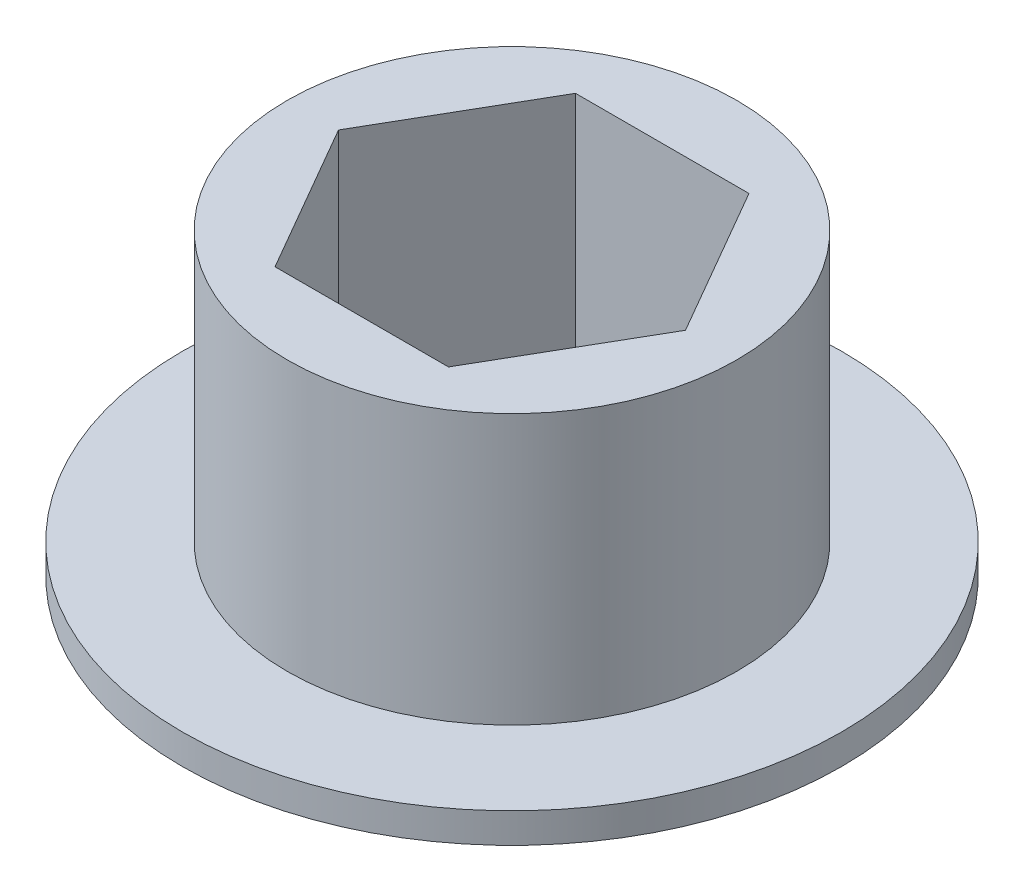
ISO-10303-21;
HEADER;
FILE_DESCRIPTION(('STEP AP214'),'2;1');
FILE_NAME('part.step','',(''),(''),'','','');
FILE_SCHEMA(('AUTOMOTIVE_DESIGN { 1 0 10303 214 1 1 1 1 }'));
ENDSEC;
DATA;
#1=APPLICATION_CONTEXT('core data for automotive mechanical design processes');
#2=APPLICATION_PROTOCOL_DEFINITION('international standard','automotive_design',2000,#1);
#3=PRODUCT_CONTEXT('',#1,'mechanical');
#4=PRODUCT('Part','Part','',(#3));
#5=PRODUCT_RELATED_PRODUCT_CATEGORY('part','',(#4));
#6=PRODUCT_DEFINITION_FORMATION('','',#4);
#7=PRODUCT_DEFINITION_CONTEXT('part definition',#1,'design');
#8=PRODUCT_DEFINITION('design','',#6,#7);
#9=PRODUCT_DEFINITION_SHAPE('','',#8);
#10=(LENGTH_UNIT() NAMED_UNIT(*) SI_UNIT(.MILLI.,.METRE.));
#11=(NAMED_UNIT(*) PLANE_ANGLE_UNIT() SI_UNIT($,.RADIAN.));
#12=(NAMED_UNIT(*) SI_UNIT($,.STERADIAN.) SOLID_ANGLE_UNIT());
#13=UNCERTAINTY_MEASURE_WITH_UNIT(LENGTH_MEASURE(1.E-05),#10,'distance_accuracy_value','');
#14=(GEOMETRIC_REPRESENTATION_CONTEXT(3) GLOBAL_UNCERTAINTY_ASSIGNED_CONTEXT((#13)) GLOBAL_UNIT_ASSIGNED_CONTEXT((#10,
#11,#12)) REPRESENTATION_CONTEXT('',''));
#15=CARTESIAN_POINT('',(0.,0.,0.));
#16=DIRECTION('',(0.,0.,1.));
#17=DIRECTION('',(1.,0.,0.));
#18=AXIS2_PLACEMENT_3D('',#15,#16,#17);
#19=CARTESIAN_POINT('',(0.,5.,0.));
#20=DIRECTION('',(0.,-1.,0.));
#21=DIRECTION('',(0.,0.,-1.));
#22=AXIS2_PLACEMENT_3D('',#19,#20,#21);
#23=CYLINDRICAL_SURFACE('',#22,7.5);
#24=CARTESIAN_POINT('',(0.,5.,0.));
#25=DIRECTION('',(0.,1.,0.));
#26=DIRECTION('',(0.,0.,1.));
#27=AXIS2_PLACEMENT_3D('',#24,#25,#26);
#28=CIRCLE('',#27,7.5);
#29=CARTESIAN_POINT('',(0.,5.,7.5));
#30=VERTEX_POINT('',#29);
#31=EDGE_CURVE('E46',#30,#30,#28,.T.);
#32=ORIENTED_EDGE('',*,*,#31,.F.);
#33=EDGE_LOOP('',(#32));
#34=FACE_BOUND('',#33,.T.);
#35=CARTESIAN_POINT('',(0.,-4.,0.));
#36=DIRECTION('',(0.,-1.,0.));
#37=DIRECTION('',(0.,0.,-1.));
#38=AXIS2_PLACEMENT_3D('',#35,#36,#37);
#39=CIRCLE('',#38,7.5);
#40=CARTESIAN_POINT('',(0.,-4.,-7.5));
#41=VERTEX_POINT('',#40);
#42=EDGE_CURVE('E11',#41,#41,#39,.T.);
#43=ORIENTED_EDGE('',*,*,#42,.F.);
#44=EDGE_LOOP('',(#43));
#45=FACE_BOUND('',#44,.T.);
#46=ADVANCED_FACE('F39',(#34,#45),#23,.T.);
#47=CARTESIAN_POINT('',(0.,5.,0.));
#48=DIRECTION('',(0.,1.,0.));
#49=DIRECTION('',(0.,0.,1.));
#50=AXIS2_PLACEMENT_3D('',#47,#48,#49);
#51=PLANE('',#50);
#52=ORIENTED_EDGE('',*,*,#31,.T.);
#53=EDGE_LOOP('',(#52));
#54=FACE_BOUND('',#53,.T.);
#55=DIRECTION('',(1.,0.,0.));
#56=VECTOR('',#55,1.);
#57=CARTESIAN_POINT('',(-2.89396822431298,5.,5.0125));
#58=LINE('',#57,#56);
#59=CARTESIAN_POINT('',(-2.89396822431298,5.,5.0125));
#60=VERTEX_POINT('',#59);
#61=CARTESIAN_POINT('',(2.89396822431301,5.,5.0125));
#62=VERTEX_POINT('',#61);
#63=EDGE_CURVE('E99',#60,#62,#58,.T.);
#64=ORIENTED_EDGE('',*,*,#63,.F.);
#65=DIRECTION('',(0.499999999999998,0.,0.86602540378444));
#66=VECTOR('',#65,1.);
#67=CARTESIAN_POINT('',(-5.78793644862597,5.,0.));
#68=LINE('',#67,#66);
#69=CARTESIAN_POINT('',(-5.78793644862597,5.,0.));
#70=VERTEX_POINT('',#69);
#71=EDGE_CURVE('E91',#70,#60,#68,.T.);
#72=ORIENTED_EDGE('',*,*,#71,.F.);
#73=DIRECTION('',(-0.499999999999998,0.,0.86602540378444));
#74=VECTOR('',#73,1.);
#75=CARTESIAN_POINT('',(-2.89396822431299,5.,-5.0125));
#76=LINE('',#75,#74);
#77=CARTESIAN_POINT('',(-2.89396822431299,5.,-5.0125));
#78=VERTEX_POINT('',#77);
#79=EDGE_CURVE('E121',#78,#70,#76,.T.);
#80=ORIENTED_EDGE('',*,*,#79,.F.);
#81=DIRECTION('',(-1.,0.,0.));
#82=VECTOR('',#81,1.);
#83=CARTESIAN_POINT('',(2.89396822431299,5.,-5.0125));
#84=LINE('',#83,#82);
#85=CARTESIAN_POINT('',(2.89396822431299,5.,-5.0125));
#86=VERTEX_POINT('',#85);
#87=EDGE_CURVE('E119',#86,#78,#84,.T.);
#88=ORIENTED_EDGE('',*,*,#87,.F.);
#89=DIRECTION('',(-0.499999999999998,0.,-0.86602540378444));
#90=VECTOR('',#89,1.);
#91=CARTESIAN_POINT('',(5.78793644862597,5.,0.));
#92=LINE('',#91,#90);
#93=CARTESIAN_POINT('',(5.78793644862597,5.,0.));
#94=VERTEX_POINT('',#93);
#95=EDGE_CURVE('E114',#94,#86,#92,.T.);
#96=ORIENTED_EDGE('',*,*,#95,.F.);
#97=DIRECTION('',(0.499999999999996,0.,-0.866025403784441));
#98=VECTOR('',#97,1.);
#99=CARTESIAN_POINT('',(2.89396822431301,5.,5.0125));
#100=LINE('',#99,#98);
#101=EDGE_CURVE('E112',#62,#94,#100,.T.);
#102=ORIENTED_EDGE('',*,*,#101,.F.);
#103=EDGE_LOOP('',(#64,#72,#80,#88,#96,#102));
#104=FACE_BOUND('',#103,.T.);
#105=ADVANCED_FACE('F110',(#54,#104),#51,.T.);
#106=CARTESIAN_POINT('',(0.,-5.,0.));
#107=DIRECTION('',(0.,1.,0.));
#108=DIRECTION('',(0.,0.,1.));
#109=AXIS2_PLACEMENT_3D('',#106,#107,#108);
#110=PLANE('',#109);
#111=DIRECTION('',(0.499999999999998,0.,0.86602540378444));
#112=VECTOR('',#111,1.);
#113=CARTESIAN_POINT('',(-5.78793644862597,-5.,0.));
#114=LINE('',#113,#112);
#115=CARTESIAN_POINT('',(-5.78793644862597,-5.,0.));
#116=VERTEX_POINT('',#115);
#117=CARTESIAN_POINT('',(-2.89396822431298,-5.,5.0125));
#118=VERTEX_POINT('',#117);
#119=EDGE_CURVE('E61',#116,#118,#114,.T.);
#120=ORIENTED_EDGE('',*,*,#119,.T.);
#121=DIRECTION('',(1.,0.,0.));
#122=VECTOR('',#121,1.);
#123=CARTESIAN_POINT('',(-2.89396822431298,-5.,5.0125));
#124=LINE('',#123,#122);
#125=CARTESIAN_POINT('',(2.89396822431301,-5.,5.0125));
#126=VERTEX_POINT('',#125);
#127=EDGE_CURVE('E106',#118,#126,#124,.T.);
#128=ORIENTED_EDGE('',*,*,#127,.T.);
#129=DIRECTION('',(0.499999999999996,0.,-0.866025403784441));
#130=VECTOR('',#129,1.);
#131=CARTESIAN_POINT('',(2.89396822431301,-5.,5.0125));
#132=LINE('',#131,#130);
#133=CARTESIAN_POINT('',(5.78793644862597,-5.,0.));
#134=VERTEX_POINT('',#133);
#135=EDGE_CURVE('E126',#126,#134,#132,.T.);
#136=ORIENTED_EDGE('',*,*,#135,.T.);
#137=DIRECTION('',(-0.499999999999998,0.,-0.86602540378444));
#138=VECTOR('',#137,1.);
#139=CARTESIAN_POINT('',(5.78793644862597,-5.,0.));
#140=LINE('',#139,#138);
#141=CARTESIAN_POINT('',(2.89396822431299,-5.,-5.0125));
#142=VERTEX_POINT('',#141);
#143=EDGE_CURVE('E129',#134,#142,#140,.T.);
#144=ORIENTED_EDGE('',*,*,#143,.T.);
#145=DIRECTION('',(-1.,0.,0.));
#146=VECTOR('',#145,1.);
#147=CARTESIAN_POINT('',(2.89396822431299,-5.,-5.0125));
#148=LINE('',#147,#146);
#149=CARTESIAN_POINT('',(-2.89396822431299,-5.,-5.0125));
#150=VERTEX_POINT('',#149);
#151=EDGE_CURVE('E132',#142,#150,#148,.T.);
#152=ORIENTED_EDGE('',*,*,#151,.T.);
#153=DIRECTION('',(-0.499999999999998,0.,0.86602540378444));
#154=VECTOR('',#153,1.);
#155=CARTESIAN_POINT('',(-2.89396822431299,-5.,-5.0125));
#156=LINE('',#155,#154);
#157=EDGE_CURVE('E100',#150,#116,#156,.T.);
#158=ORIENTED_EDGE('',*,*,#157,.T.);
#159=EDGE_LOOP('',(#120,#128,#136,#144,#152,#158));
#160=FACE_BOUND('',#159,.T.);
#161=CARTESIAN_POINT('',(0.,-5.,0.));
#162=DIRECTION('',(0.,-1.,0.));
#163=DIRECTION('',(0.,0.,-1.));
#164=AXIS2_PLACEMENT_3D('',#161,#162,#163);
#165=CIRCLE('',#164,11.);
#166=CARTESIAN_POINT('',(0.,-5.,-11.));
#167=VERTEX_POINT('',#166);
#168=EDGE_CURVE('E159',#167,#167,#165,.T.);
#169=ORIENTED_EDGE('',*,*,#168,.T.);
#170=EDGE_LOOP('',(#169));
#171=FACE_BOUND('',#170,.T.);
#172=ADVANCED_FACE('F164',(#160,#171),#110,.F.);
#173=CARTESIAN_POINT('',(-5.78793644862597,5.,0.));
#174=DIRECTION('',(0.86602540378444,0.,-0.499999999999998));
#175=DIRECTION('',(-0.499999999999998,0.,-0.86602540378444));
#176=AXIS2_PLACEMENT_3D('',#173,#174,#175);
#177=PLANE('',#176);
#178=ORIENTED_EDGE('',*,*,#119,.F.);
#179=DIRECTION('',(0.,-1.,0.));
#180=VECTOR('',#179,1.);
#181=CARTESIAN_POINT('',(-5.78793644862597,5.,0.));
#182=LINE('',#181,#180);
#183=EDGE_CURVE('E95',#70,#116,#182,.T.);
#184=ORIENTED_EDGE('',*,*,#183,.F.);
#185=ORIENTED_EDGE('',*,*,#71,.T.);
#186=DIRECTION('',(0.,-1.,0.));
#187=VECTOR('',#186,1.);
#188=CARTESIAN_POINT('',(-2.89396822431298,5.,5.0125));
#189=LINE('',#188,#187);
#190=EDGE_CURVE('E94',#60,#118,#189,.T.);
#191=ORIENTED_EDGE('',*,*,#190,.T.);
#192=EDGE_LOOP('',(#178,#184,#185,#191));
#193=FACE_BOUND('',#192,.T.);
#194=ADVANCED_FACE('F93',(#193),#177,.T.);
#195=CARTESIAN_POINT('',(-2.89396822431298,5.,5.0125));
#196=DIRECTION('',(0.,0.,-1.));
#197=DIRECTION('',(-1.,0.,0.));
#198=AXIS2_PLACEMENT_3D('',#195,#196,#197);
#199=PLANE('',#198);
#200=ORIENTED_EDGE('',*,*,#127,.F.);
#201=ORIENTED_EDGE('',*,*,#190,.F.);
#202=ORIENTED_EDGE('',*,*,#63,.T.);
#203=DIRECTION('',(0.,-1.,0.));
#204=VECTOR('',#203,1.);
#205=CARTESIAN_POINT('',(2.89396822431301,5.,5.0125));
#206=LINE('',#205,#204);
#207=EDGE_CURVE('E107',#62,#126,#206,.T.);
#208=ORIENTED_EDGE('',*,*,#207,.T.);
#209=EDGE_LOOP('',(#200,#201,#202,#208));
#210=FACE_BOUND('',#209,.T.);
#211=ADVANCED_FACE('F103',(#210),#199,.T.);
#212=CARTESIAN_POINT('',(2.89396822431301,5.,5.0125));
#213=DIRECTION('',(-0.866025403784441,0.,-0.499999999999996));
#214=DIRECTION('',(-0.499999999999996,0.,0.866025403784441));
#215=AXIS2_PLACEMENT_3D('',#212,#213,#214);
#216=PLANE('',#215);
#217=ORIENTED_EDGE('',*,*,#135,.F.);
#218=ORIENTED_EDGE('',*,*,#207,.F.);
#219=ORIENTED_EDGE('',*,*,#101,.T.);
#220=DIRECTION('',(0.,-1.,0.));
#221=VECTOR('',#220,1.);
#222=CARTESIAN_POINT('',(5.78793644862597,5.,0.));
#223=LINE('',#222,#221);
#224=EDGE_CURVE('E141',#94,#134,#223,.T.);
#225=ORIENTED_EDGE('',*,*,#224,.T.);
#226=EDGE_LOOP('',(#217,#218,#219,#225));
#227=FACE_BOUND('',#226,.T.);
#228=ADVANCED_FACE('F182',(#227),#216,.T.);
#229=CARTESIAN_POINT('',(5.78793644862597,5.,0.));
#230=DIRECTION('',(-0.86602540378444,0.,0.499999999999998));
#231=DIRECTION('',(0.499999999999998,0.,0.86602540378444));
#232=AXIS2_PLACEMENT_3D('',#229,#230,#231);
#233=PLANE('',#232);
#234=ORIENTED_EDGE('',*,*,#143,.F.);
#235=ORIENTED_EDGE('',*,*,#224,.F.);
#236=ORIENTED_EDGE('',*,*,#95,.T.);
#237=DIRECTION('',(0.,-1.,0.));
#238=VECTOR('',#237,1.);
#239=CARTESIAN_POINT('',(2.89396822431299,5.,-5.0125));
#240=LINE('',#239,#238);
#241=EDGE_CURVE('E139',#86,#142,#240,.T.);
#242=ORIENTED_EDGE('',*,*,#241,.T.);
#243=EDGE_LOOP('',(#234,#235,#236,#242));
#244=FACE_BOUND('',#243,.T.);
#245=ADVANCED_FACE('F178',(#244),#233,.T.);
#246=CARTESIAN_POINT('',(2.89396822431299,5.,-5.0125));
#247=DIRECTION('',(0.,0.,1.));
#248=DIRECTION('',(1.,0.,0.));
#249=AXIS2_PLACEMENT_3D('',#246,#247,#248);
#250=PLANE('',#249);
#251=ORIENTED_EDGE('',*,*,#151,.F.);
#252=ORIENTED_EDGE('',*,*,#241,.F.);
#253=ORIENTED_EDGE('',*,*,#87,.T.);
#254=DIRECTION('',(0.,-1.,0.));
#255=VECTOR('',#254,1.);
#256=CARTESIAN_POINT('',(-2.89396822431299,5.,-5.0125));
#257=LINE('',#256,#255);
#258=EDGE_CURVE('E53',#78,#150,#257,.T.);
#259=ORIENTED_EDGE('',*,*,#258,.T.);
#260=EDGE_LOOP('',(#251,#252,#253,#259));
#261=FACE_BOUND('',#260,.T.);
#262=ADVANCED_FACE('F173',(#261),#250,.T.);
#263=CARTESIAN_POINT('',(-2.89396822431299,5.,-5.0125));
#264=DIRECTION('',(0.86602540378444,0.,0.499999999999998));
#265=DIRECTION('',(0.499999999999998,0.,-0.86602540378444));
#266=AXIS2_PLACEMENT_3D('',#263,#264,#265);
#267=PLANE('',#266);
#268=ORIENTED_EDGE('',*,*,#157,.F.);
#269=ORIENTED_EDGE('',*,*,#258,.F.);
#270=ORIENTED_EDGE('',*,*,#79,.T.);
#271=ORIENTED_EDGE('',*,*,#183,.T.);
#272=EDGE_LOOP('',(#268,#269,#270,#271));
#273=FACE_BOUND('',#272,.T.);
#274=ADVANCED_FACE('F167',(#273),#267,.T.);
#275=CARTESIAN_POINT('',(0.,-4.,0.));
#276=DIRECTION('',(0.,-1.,0.));
#277=DIRECTION('',(0.,0.,-1.));
#278=AXIS2_PLACEMENT_3D('',#275,#276,#277);
#279=CYLINDRICAL_SURFACE('',#278,11.);
#280=CARTESIAN_POINT('',(0.,-4.,0.));
#281=DIRECTION('',(0.,-1.,0.));
#282=DIRECTION('',(0.,0.,-1.));
#283=AXIS2_PLACEMENT_3D('',#280,#281,#282);
#284=CIRCLE('',#283,11.);
#285=CARTESIAN_POINT('',(0.,-4.,-11.));
#286=VERTEX_POINT('',#285);
#287=EDGE_CURVE('E124',#286,#286,#284,.T.);
#288=ORIENTED_EDGE('',*,*,#287,.T.);
#289=EDGE_LOOP('',(#288));
#290=FACE_BOUND('',#289,.T.);
#291=ORIENTED_EDGE('',*,*,#168,.F.);
#292=EDGE_LOOP('',(#291));
#293=FACE_BOUND('',#292,.T.);
#294=ADVANCED_FACE('F154',(#290,#293),#279,.T.);
#295=CARTESIAN_POINT('',(0.,-4.,0.));
#296=DIRECTION('',(0.,-1.,0.));
#297=DIRECTION('',(0.,0.,-1.));
#298=AXIS2_PLACEMENT_3D('',#295,#296,#297);
#299=PLANE('',#298);
#300=ORIENTED_EDGE('',*,*,#42,.T.);
#301=EDGE_LOOP('',(#300));
#302=FACE_BOUND('',#301,.T.);
#303=ORIENTED_EDGE('',*,*,#287,.F.);
#304=EDGE_LOOP('',(#303));
#305=FACE_BOUND('',#304,.T.);
#306=ADVANCED_FACE('F151',(#302,#305),#299,.F.);
#307=CLOSED_SHELL('',(#46,#105,#172,#194,#211,#228,#245,#262,#274,#294,#306));
#308=MANIFOLD_SOLID_BREP('B2',#307);
#309=ADVANCED_BREP_SHAPE_REPRESENTATION('',(#18,#308),#14);
#310=SHAPE_DEFINITION_REPRESENTATION(#9,#309);
ENDSEC;
END-ISO-10303-21;
